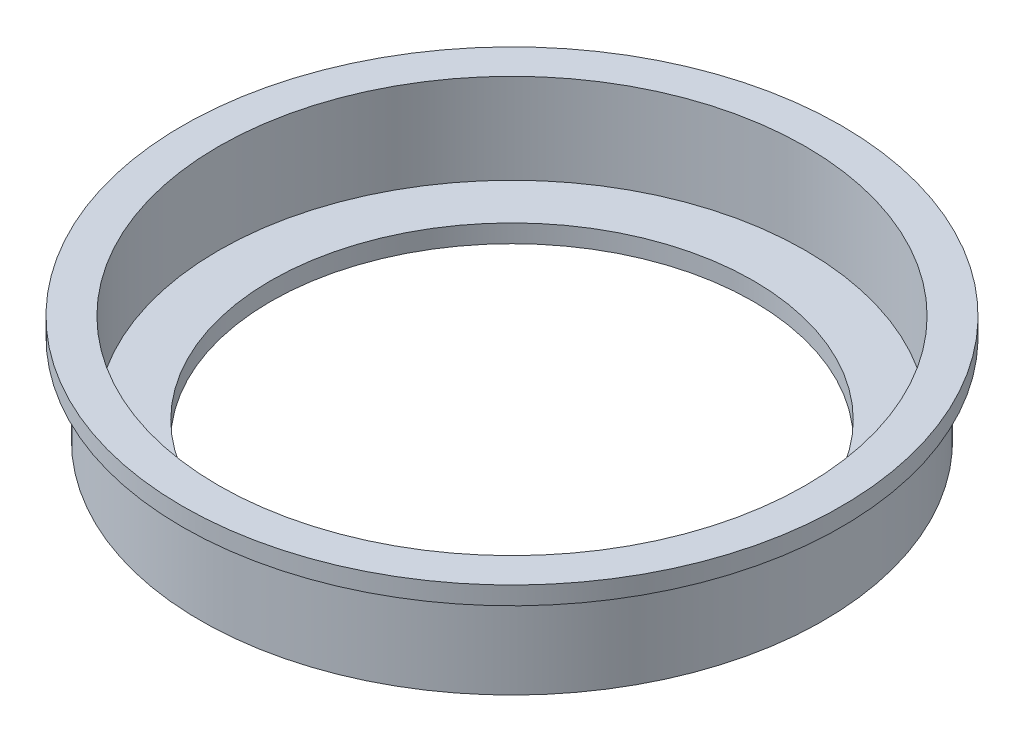
ISO-10303-21;
HEADER;
FILE_DESCRIPTION(('STEP AP214'),'2;1');
FILE_NAME('part.step','',(''),(''),'','','');
FILE_SCHEMA(('AUTOMOTIVE_DESIGN { 1 0 10303 214 1 1 1 1 }'));
ENDSEC;
DATA;
#1=APPLICATION_CONTEXT('core data for automotive mechanical design processes');
#2=APPLICATION_PROTOCOL_DEFINITION('international standard','automotive_design',2000,#1);
#3=PRODUCT_CONTEXT('',#1,'mechanical');
#4=PRODUCT('Part','Part','',(#3));
#5=PRODUCT_RELATED_PRODUCT_CATEGORY('part','',(#4));
#6=PRODUCT_DEFINITION_FORMATION('','',#4);
#7=PRODUCT_DEFINITION_CONTEXT('part definition',#1,'design');
#8=PRODUCT_DEFINITION('design','',#6,#7);
#9=PRODUCT_DEFINITION_SHAPE('','',#8);
#10=(LENGTH_UNIT() NAMED_UNIT(*) SI_UNIT(.MILLI.,.METRE.));
#11=(NAMED_UNIT(*) PLANE_ANGLE_UNIT() SI_UNIT($,.RADIAN.));
#12=(NAMED_UNIT(*) SI_UNIT($,.STERADIAN.) SOLID_ANGLE_UNIT());
#13=UNCERTAINTY_MEASURE_WITH_UNIT(LENGTH_MEASURE(1.E-05),#10,'distance_accuracy_value','');
#14=(GEOMETRIC_REPRESENTATION_CONTEXT(3) GLOBAL_UNCERTAINTY_ASSIGNED_CONTEXT((#13)) GLOBAL_UNIT_ASSIGNED_CONTEXT((#10,
#11,#12)) REPRESENTATION_CONTEXT('',''));
#15=CARTESIAN_POINT('',(0.,0.,0.));
#16=DIRECTION('',(0.,0.,1.));
#17=DIRECTION('',(1.,0.,0.));
#18=AXIS2_PLACEMENT_3D('',#15,#16,#17);
#19=CARTESIAN_POINT('',(43.942,0.,0.));
#20=DIRECTION('',(0.,-1.,0.));
#21=DIRECTION('',(0.,0.,-1.));
#22=AXIS2_PLACEMENT_3D('',#19,#20,#21);
#23=PLANE('',#22);
#24=CARTESIAN_POINT('',(0.,0.,0.));
#25=DIRECTION('',(0.,-1.,0.));
#26=DIRECTION('',(0.,0.,-1.));
#27=AXIS2_PLACEMENT_3D('',#24,#25,#26);
#28=CIRCLE('',#27,43.942);
#29=CARTESIAN_POINT('',(0.,0.,-43.942));
#30=VERTEX_POINT('',#29);
#31=EDGE_CURVE('E62',#30,#30,#28,.T.);
#32=ORIENTED_EDGE('',*,*,#31,.T.);
#33=EDGE_LOOP('',(#32));
#34=FACE_BOUND('',#33,.T.);
#35=CARTESIAN_POINT('',(0.,0.,0.));
#36=DIRECTION('',(0.,-1.,0.));
#37=DIRECTION('',(0.,0.,-1.));
#38=AXIS2_PLACEMENT_3D('',#35,#36,#37);
#39=CIRCLE('',#38,34.036);
#40=CARTESIAN_POINT('',(0.,0.,-34.036));
#41=VERTEX_POINT('',#40);
#42=EDGE_CURVE('E10',#41,#41,#39,.T.);
#43=ORIENTED_EDGE('',*,*,#42,.F.);
#44=EDGE_LOOP('',(#43));
#45=FACE_BOUND('',#44,.T.);
#46=ADVANCED_FACE('F34',(#34,#45),#23,.T.);
#47=CARTESIAN_POINT('',(0.,0.,0.));
#48=DIRECTION('',(0.,-1.,0.));
#49=DIRECTION('',(0.,0.,-1.));
#50=AXIS2_PLACEMENT_3D('',#47,#48,#49);
#51=CYLINDRICAL_SURFACE('',#50,34.036);
#52=ORIENTED_EDGE('',*,*,#42,.T.);
#53=EDGE_LOOP('',(#52));
#54=FACE_BOUND('',#53,.T.);
#55=CARTESIAN_POINT('',(0.,2.54000000000001,0.));
#56=DIRECTION('',(0.,-1.,0.));
#57=DIRECTION('',(0.,0.,-1.));
#58=AXIS2_PLACEMENT_3D('',#55,#56,#57);
#59=CIRCLE('',#58,34.036);
#60=CARTESIAN_POINT('',(0.,2.54000000000001,-34.036));
#61=VERTEX_POINT('',#60);
#62=EDGE_CURVE('E40',#61,#61,#59,.T.);
#63=ORIENTED_EDGE('',*,*,#62,.F.);
#64=EDGE_LOOP('',(#63));
#65=FACE_BOUND('',#64,.T.);
#66=ADVANCED_FACE('F80',(#54,#65),#51,.F.);
#67=CARTESIAN_POINT('',(34.036,2.54000000000001,0.));
#68=DIRECTION('',(0.,1.,0.));
#69=DIRECTION('',(0.,0.,1.));
#70=AXIS2_PLACEMENT_3D('',#67,#68,#69);
#71=PLANE('',#70);
#72=ORIENTED_EDGE('',*,*,#62,.T.);
#73=EDGE_LOOP('',(#72));
#74=FACE_BOUND('',#73,.T.);
#75=CARTESIAN_POINT('',(0.,2.54000000000002,0.));
#76=DIRECTION('',(0.,-1.,0.));
#77=DIRECTION('',(0.,0.,-1.));
#78=AXIS2_PLACEMENT_3D('',#75,#76,#77);
#79=CIRCLE('',#78,41.402);
#80=CARTESIAN_POINT('',(0.,2.54000000000002,-41.402));
#81=VERTEX_POINT('',#80);
#82=EDGE_CURVE('E44',#81,#81,#79,.T.);
#83=ORIENTED_EDGE('',*,*,#82,.F.);
#84=EDGE_LOOP('',(#83));
#85=FACE_BOUND('',#84,.T.);
#86=ADVANCED_FACE('F84',(#74,#85),#71,.T.);
#87=CARTESIAN_POINT('',(0.,0.,0.));
#88=DIRECTION('',(0.,-1.,0.));
#89=DIRECTION('',(0.,0.,-1.));
#90=AXIS2_PLACEMENT_3D('',#87,#88,#89);
#91=CYLINDRICAL_SURFACE('',#90,41.402);
#92=ORIENTED_EDGE('',*,*,#82,.T.);
#93=EDGE_LOOP('',(#92));
#94=FACE_BOUND('',#93,.T.);
#95=CARTESIAN_POINT('',(0.,15.24,0.));
#96=DIRECTION('',(0.,-1.,0.));
#97=DIRECTION('',(0.,0.,-1.));
#98=AXIS2_PLACEMENT_3D('',#95,#96,#97);
#99=CIRCLE('',#98,41.402);
#100=CARTESIAN_POINT('',(0.,15.24,-41.402));
#101=VERTEX_POINT('',#100);
#102=EDGE_CURVE('E48',#101,#101,#99,.T.);
#103=ORIENTED_EDGE('',*,*,#102,.F.);
#104=EDGE_LOOP('',(#103));
#105=FACE_BOUND('',#104,.T.);
#106=ADVANCED_FACE('F88',(#94,#105),#91,.F.);
#107=CARTESIAN_POINT('',(41.402,15.24,0.));
#108=DIRECTION('',(0.,1.,0.));
#109=DIRECTION('',(0.,0.,1.));
#110=AXIS2_PLACEMENT_3D('',#107,#108,#109);
#111=PLANE('',#110);
#112=ORIENTED_EDGE('',*,*,#102,.T.);
#113=EDGE_LOOP('',(#112));
#114=FACE_BOUND('',#113,.T.);
#115=CARTESIAN_POINT('',(0.,15.24,0.));
#116=DIRECTION('',(0.,-1.,0.));
#117=DIRECTION('',(0.,0.,-1.));
#118=AXIS2_PLACEMENT_3D('',#115,#116,#117);
#119=CIRCLE('',#118,46.482);
#120=CARTESIAN_POINT('',(0.,15.24,-46.482));
#121=VERTEX_POINT('',#120);
#122=EDGE_CURVE('E53',#121,#121,#119,.T.);
#123=ORIENTED_EDGE('',*,*,#122,.F.);
#124=EDGE_LOOP('',(#123));
#125=FACE_BOUND('',#124,.T.);
#126=ADVANCED_FACE('F94',(#114,#125),#111,.T.);
#127=CARTESIAN_POINT('',(0.,0.,0.));
#128=DIRECTION('',(0.,-1.,0.));
#129=DIRECTION('',(0.,0.,-1.));
#130=AXIS2_PLACEMENT_3D('',#127,#128,#129);
#131=CYLINDRICAL_SURFACE('',#130,46.482);
#132=ORIENTED_EDGE('',*,*,#122,.T.);
#133=EDGE_LOOP('',(#132));
#134=FACE_BOUND('',#133,.T.);
#135=CARTESIAN_POINT('',(0.,12.7,0.));
#136=DIRECTION('',(0.,-1.,0.));
#137=DIRECTION('',(0.,0.,-1.));
#138=AXIS2_PLACEMENT_3D('',#135,#136,#137);
#139=CIRCLE('',#138,46.482);
#140=CARTESIAN_POINT('',(0.,12.7,-46.482));
#141=VERTEX_POINT('',#140);
#142=EDGE_CURVE('E56',#141,#141,#139,.T.);
#143=ORIENTED_EDGE('',*,*,#142,.F.);
#144=EDGE_LOOP('',(#143));
#145=FACE_BOUND('',#144,.T.);
#146=ADVANCED_FACE('F76',(#134,#145),#131,.T.);
#147=CARTESIAN_POINT('',(46.482,12.7,0.));
#148=DIRECTION('',(0.,-1.,0.));
#149=DIRECTION('',(0.,0.,-1.));
#150=AXIS2_PLACEMENT_3D('',#147,#148,#149);
#151=PLANE('',#150);
#152=ORIENTED_EDGE('',*,*,#142,.T.);
#153=EDGE_LOOP('',(#152));
#154=FACE_BOUND('',#153,.T.);
#155=CARTESIAN_POINT('',(0.,12.7,0.));
#156=DIRECTION('',(0.,-1.,0.));
#157=DIRECTION('',(0.,0.,-1.));
#158=AXIS2_PLACEMENT_3D('',#155,#156,#157);
#159=CIRCLE('',#158,43.942);
#160=CARTESIAN_POINT('',(0.,12.7,-43.942));
#161=VERTEX_POINT('',#160);
#162=EDGE_CURVE('E59',#161,#161,#159,.T.);
#163=ORIENTED_EDGE('',*,*,#162,.F.);
#164=EDGE_LOOP('',(#163));
#165=FACE_BOUND('',#164,.T.);
#166=ADVANCED_FACE('F70',(#154,#165),#151,.T.);
#167=CARTESIAN_POINT('',(0.,0.,0.));
#168=DIRECTION('',(0.,-1.,0.));
#169=DIRECTION('',(0.,0.,-1.));
#170=AXIS2_PLACEMENT_3D('',#167,#168,#169);
#171=CYLINDRICAL_SURFACE('',#170,43.942);
#172=ORIENTED_EDGE('',*,*,#162,.T.);
#173=EDGE_LOOP('',(#172));
#174=FACE_BOUND('',#173,.T.);
#175=ORIENTED_EDGE('',*,*,#31,.F.);
#176=EDGE_LOOP('',(#175));
#177=FACE_BOUND('',#176,.T.);
#178=ADVANCED_FACE('F68',(#174,#177),#171,.T.);
#179=CLOSED_SHELL('',(#46,#66,#86,#106,#126,#146,#166,#178));
#180=MANIFOLD_SOLID_BREP('B2',#179);
#181=ADVANCED_BREP_SHAPE_REPRESENTATION('',(#18,#180),#14);
#182=SHAPE_DEFINITION_REPRESENTATION(#9,#181);
ENDSEC;
END-ISO-10303-21;
